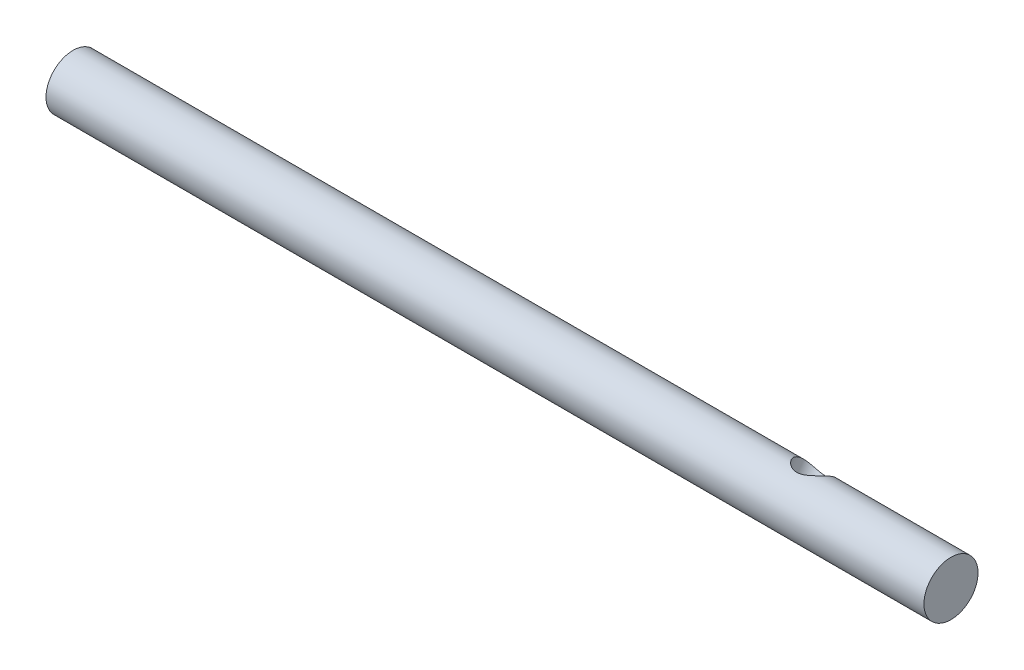
ISO-10303-21;
HEADER;
FILE_DESCRIPTION(('STEP AP214'),'2;1');
FILE_NAME('part.step','',(''),(''),'','','');
FILE_SCHEMA(('AUTOMOTIVE_DESIGN { 1 0 10303 214 1 1 1 1 }'));
ENDSEC;
DATA;
#1=APPLICATION_CONTEXT('core data for automotive mechanical design processes');
#2=APPLICATION_PROTOCOL_DEFINITION('international standard','automotive_design',2000,#1);
#3=PRODUCT_CONTEXT('',#1,'mechanical');
#4=PRODUCT('Part','Part','',(#3));
#5=PRODUCT_RELATED_PRODUCT_CATEGORY('part','',(#4));
#6=PRODUCT_DEFINITION_FORMATION('','',#4);
#7=PRODUCT_DEFINITION_CONTEXT('part definition',#1,'design');
#8=PRODUCT_DEFINITION('design','',#6,#7);
#9=PRODUCT_DEFINITION_SHAPE('','',#8);
#10=(LENGTH_UNIT() NAMED_UNIT(*) SI_UNIT(.MILLI.,.METRE.));
#11=(NAMED_UNIT(*) PLANE_ANGLE_UNIT() SI_UNIT($,.RADIAN.));
#12=(NAMED_UNIT(*) SI_UNIT($,.STERADIAN.) SOLID_ANGLE_UNIT());
#13=UNCERTAINTY_MEASURE_WITH_UNIT(LENGTH_MEASURE(1.E-05),#10,'distance_accuracy_value','');
#14=(GEOMETRIC_REPRESENTATION_CONTEXT(3) GLOBAL_UNCERTAINTY_ASSIGNED_CONTEXT((#13)) GLOBAL_UNIT_ASSIGNED_CONTEXT((#10,
#11,#12)) REPRESENTATION_CONTEXT('',''));
#15=CARTESIAN_POINT('',(0.,0.,0.));
#16=DIRECTION('',(0.,0.,1.));
#17=DIRECTION('',(1.,0.,0.));
#18=AXIS2_PLACEMENT_3D('',#15,#16,#17);
#19=CARTESIAN_POINT('',(75.,0.,0.));
#20=DIRECTION('',(-1.,0.,0.));
#21=DIRECTION('',(0.,0.,1.));
#22=AXIS2_PLACEMENT_3D('',#19,#20,#21);
#23=CYLINDRICAL_SURFACE('',#22,4.);
#24=CARTESIAN_POINT('',(54.8,0.,0.));
#25=DIRECTION('',(-1.,0.,0.));
#26=DIRECTION('',(0.,0.,1.));
#27=AXIS2_PLACEMENT_3D('',#24,#25,#26);
#28=CIRCLE('',#27,4.);
#29=CARTESIAN_POINT('',(54.8,0.,4.));
#30=VERTEX_POINT('',#29);
#31=EDGE_CURVE('E49',#30,#30,#28,.T.);
#32=ORIENTED_EDGE('',*,*,#31,.T.);
#33=EDGE_LOOP('',(#32));
#34=FACE_BOUND('',#33,.T.);
#35=CARTESIAN_POINT('',(-75.,0.,0.));
#36=DIRECTION('',(1.,0.,0.));
#37=DIRECTION('',(0.,0.,-1.));
#38=AXIS2_PLACEMENT_3D('',#35,#36,#37);
#39=CIRCLE('',#38,4.);
#40=CARTESIAN_POINT('',(-75.,0.,-4.));
#41=VERTEX_POINT('',#40);
#42=EDGE_CURVE('E10',#41,#41,#39,.T.);
#43=ORIENTED_EDGE('',*,*,#42,.T.);
#44=EDGE_LOOP('',(#43));
#45=FACE_BOUND('',#44,.T.);
#46=CARTESIAN_POINT('',(32.5,3.96760598785773,0.508038113841386));
#47=CARTESIAN_POINT('',(32.5621567514455,3.96760646337398,0.508037133767158));
#48=CARTESIAN_POINT('',(32.6243259466708,3.96798846958562,0.505082249115958));
#49=CARTESIAN_POINT('',(32.7481171795478,3.96946195000299,0.493356950870116));
#50=CARTESIAN_POINT('',(32.8097388732572,3.97055384206564,0.484583112029408));
#51=CARTESIAN_POINT('',(32.9932260477438,3.97470305889359,0.449796240194982));
#52=CARTESIAN_POINT('',(33.1135483311891,3.97863334539979,0.415318719272425));
#53=CARTESIAN_POINT('',(33.3455981978784,3.98681908924776,0.327357809187419));
#54=CARTESIAN_POINT('',(33.4573904150553,3.9910714823592,0.274039276072373));
#55=CARTESIAN_POINT('',(33.6720085253343,3.9975906488025,0.151727507772478));
#56=CARTESIAN_POINT('',(33.7748341737533,3.99985736796381,0.0827338450239749));
#57=CARTESIAN_POINT('',(33.9837339813039,4.0001474708343,-0.0782099803206769));
#58=CARTESIAN_POINT('',(34.0883933250048,3.99756079281937,-0.171998155787628));
#59=CARTESIAN_POINT('',(34.2837615516242,3.98387606959623,-0.37267210298567));
#60=CARTESIAN_POINT('',(34.3744582799541,3.97277065849401,-0.479569142321151));
#61=CARTESIAN_POINT('',(34.5502202981733,3.93723893065368,-0.717058541463337));
#62=CARTESIAN_POINT('',(34.6332861844511,3.91136719813231,-0.848953722227008));
#63=CARTESIAN_POINT('',(34.740545154737,3.85969848837524,-1.05245618022581));
#64=CARTESIAN_POINT('',(34.7734151383339,3.84032462930766,-1.12125425355681));
#65=CARTESIAN_POINT('',(34.8329546853642,3.79703556932582,-1.26007504310192));
#66=CARTESIAN_POINT('',(34.8596285310393,3.77312352570922,-1.33009687735458));
#67=CARTESIAN_POINT('',(34.9039838152572,3.72327429475606,-1.46348081326752));
#68=CARTESIAN_POINT('',(34.9223019765191,3.69778669692256,-1.52680002767152));
#69=CARTESIAN_POINT('',(34.9533022863144,3.64304982143287,-1.65315582331957));
#70=CARTESIAN_POINT('',(34.9659876892173,3.61380272848308,-1.71619254687884));
#71=CARTESIAN_POINT('',(34.9855137976356,3.55167135750614,-1.84133203349514));
#72=CARTESIAN_POINT('',(34.9923581165145,3.51878934232741,-1.90343535057281));
#73=CARTESIAN_POINT('',(35.0000992133904,3.44963446447042,-2.02607729684202));
#74=CARTESIAN_POINT('',(35.0009966759645,3.41336199257485,-2.086616105334));
#75=CARTESIAN_POINT('',(34.9952746264539,3.31011380074642,-2.24898808420586));
#76=CARTESIAN_POINT('',(34.9826934969223,3.24004415233395,-2.3487265055166));
#77=CARTESIAN_POINT('',(34.9402697820351,3.09317965354079,-2.53904151600358));
#78=CARTESIAN_POINT('',(34.9104258920276,3.01638429522954,-2.62961741210407));
#79=CARTESIAN_POINT('',(34.8347914407179,2.85867443349045,-2.80027071143355));
#80=CARTESIAN_POINT('',(34.7889600804301,2.7777498479828,-2.8803205261576));
#81=CARTESIAN_POINT('',(34.6830627610169,2.61482037124375,-3.02900993017709));
#82=CARTESIAN_POINT('',(34.6229935589375,2.53281523792061,-3.0976469139023));
#83=CARTESIAN_POINT('',(34.4819435830775,2.36029443664313,-3.23146356879784));
#84=CARTESIAN_POINT('',(34.3992907233107,2.26998967368184,-3.29515000744864));
#85=CARTESIAN_POINT('',(34.2197352627941,2.09502887192758,-3.40907352658947));
#86=CARTESIAN_POINT('',(34.1228119536172,2.01038130652956,-3.45929075740001));
#87=CARTESIAN_POINT('',(33.9025887468277,1.8403273487674,-3.55299696342969));
#88=CARTESIAN_POINT('',(33.777497236643,1.75626541116432,-3.59475091144558));
#89=CARTESIAN_POINT('',(33.5127077626997,1.60743901204859,-3.66372636960703));
#90=CARTESIAN_POINT('',(33.3730373125479,1.5426390578519,-3.69097468248396));
#91=CARTESIAN_POINT('',(33.1204611938947,1.45369083849844,-3.72672099748441));
#92=CARTESIAN_POINT('',(33.0101780747874,1.42333321165388,-3.73826567048842));
#93=CARTESIAN_POINT('',(32.7857696224409,1.3802949283096,-3.75437533227027));
#94=CARTESIAN_POINT('',(32.6716497573439,1.36759012272249,-3.75894985705169));
#95=CARTESIAN_POINT('',(32.4425426394981,1.36127569523967,-3.76124238571308));
#96=CARTESIAN_POINT('',(32.3275539995221,1.36770983270951,-3.75894467682121));
#97=CARTESIAN_POINT('',(32.1004388356819,1.39899829584411,-3.74740770650197));
#98=CARTESIAN_POINT('',(31.9883147616291,1.42386787591763,-3.73816269644251));
#99=CARTESIAN_POINT('',(31.7715632405745,1.48888953474344,-3.71273290739743));
#100=CARTESIAN_POINT('',(31.6668426841058,1.52878293208048,-3.69666503882699));
#101=CARTESIAN_POINT('',(31.4644253001062,1.62078941217104,-3.65725868047772));
#102=CARTESIAN_POINT('',(31.366730981122,1.67290683119242,-3.63391760968415));
#103=CARTESIAN_POINT('',(31.1613880583367,1.79725695156998,-3.57427933044108));
#104=CARTESIAN_POINT('',(31.055385472698,1.8714302305422,-3.53636148480979));
#105=CARTESIAN_POINT('',(30.8556293393454,2.02876249635853,-3.44851480169962));
#106=CARTESIAN_POINT('',(30.7618886787573,2.11193077181958,-3.39857348177079));
#107=CARTESIAN_POINT('',(30.5740359293586,2.29735645761288,-3.27663867071156));
#108=CARTESIAN_POINT('',(30.4822726015146,2.40053687607224,-3.2023936083623));
#109=CARTESIAN_POINT('',(30.3198529852796,2.60865202943235,-3.03523627809282));
#110=CARTESIAN_POINT('',(30.2491868048724,2.71358591771828,-2.94233279300979));
#111=CARTESIAN_POINT('',(30.1634189320242,2.86476256098932,-2.79245688034801));
#112=CARTESIAN_POINT('',(30.1387025560479,2.91267821475926,-2.74248693202896));
#113=CARTESIAN_POINT('',(30.0950617232668,3.00698149450986,-2.6387423831278));
#114=CARTESIAN_POINT('',(30.0761339138482,3.05336999104053,-2.58497000713657));
#115=CARTESIAN_POINT('',(30.0443941698598,3.14397272649203,-2.47397684708055));
#116=CARTESIAN_POINT('',(30.0315769004826,3.18818883165242,-2.4167591203243));
#117=CARTESIAN_POINT('',(30.0122608277061,3.27389477889936,-2.29932775402522));
#118=CARTESIAN_POINT('',(30.0057609790682,3.31538507092135,-2.23911461181755));
#119=CARTESIAN_POINT('',(29.9969284844918,3.42319796377469,-2.07297201323309));
#120=CARTESIAN_POINT('',(30.0007342070895,3.4864815087952,-1.96465174493676));
#121=CARTESIAN_POINT('',(30.0269175895443,3.60173949654348,-1.74440783625371));
#122=CARTESIAN_POINT('',(30.0492944066776,3.65371445230028,-1.63248435959583));
#123=CARTESIAN_POINT('',(30.1103224155448,3.74412813997005,-1.41250198674164));
#124=CARTESIAN_POINT('',(30.1483820735634,3.78297392348008,-1.30444372691554));
#125=CARTESIAN_POINT('',(30.2391194624421,3.84989905221422,-1.09122948614603));
#126=CARTESIAN_POINT('',(30.2917996595658,3.87797657909159,-0.986073998149482));
#127=CARTESIAN_POINT('',(30.4163212787186,3.92680896656312,-0.770468351191028));
#128=CARTESIAN_POINT('',(30.4895839907561,3.94650128754159,-0.660601505382594));
#129=CARTESIAN_POINT('',(30.6501532325127,3.97601968046254,-0.450101678565831));
#130=CARTESIAN_POINT('',(30.7374756088328,3.98583452795371,-0.349479320379346));
#131=CARTESIAN_POINT('',(30.9382325150604,3.99878572582302,-0.146526226105475));
#132=CARTESIAN_POINT('',(31.05361661257,4.00075550958596,-0.0460398415495947));
#133=CARTESIAN_POINT('',(31.2992894097584,3.99875268898497,0.134744803150844));
#134=CARTESIAN_POINT('',(31.4295698111512,3.99478337836106,0.215054224319079));
#135=CARTESIAN_POINT('',(31.6728053007836,3.98630029662755,0.334960513470497));
#136=CARTESIAN_POINT('',(31.7832705721522,3.98209818167976,0.379626603474896));
#137=CARTESIAN_POINT('',(32.0099393430004,3.97475855054525,0.450090651334803));
#138=CARTESIAN_POINT('',(32.1261234197984,3.97161768207595,0.475948325627414));
#139=CARTESIAN_POINT('',(32.286059994645,3.96902326149096,0.496863446198028));
#140=CARTESIAN_POINT('',(32.3287255257078,3.9684956997781,0.50104604479768));
#141=CARTESIAN_POINT('',(32.4142586989513,3.96778685542303,0.506634065829735));
#142=CARTESIAN_POINT('',(32.4571263892432,3.9676056598628,0.508038789863218));
#143=CARTESIAN_POINT('',(32.5,3.96760598785773,0.508038113841386));
#144=B_SPLINE_CURVE_WITH_KNOTS('',3,(#46,#47,#48,#49,#50,#51,#52,#53,#54,#55,#56,#57,#58,#59,
#60,#61,#62,#63,#64,#65,#66,#67,#68,#69,#70,#71,#72,#73,#74,#75,#76,#77,#78,#79,#80,#81,#82,#83,
#84,#85,#86,#87,#88,#89,#90,#91,#92,#93,#94,#95,#96,#97,#98,#99,#100,#101,#102,#103,#104,#105,
#106,#107,#108,#109,#110,#111,#112,#113,#114,#115,#116,#117,#118,#119,#120,#121,#122,#123,#124,
#125,#126,#127,#128,#129,#130,#131,#132,#133,#134,#135,#136,#137,#138,#139,#140,#141,#142,#143),
.UNSPECIFIED.,.T.,.F.,(4,2,2,2,2,2,2,2,2,2,2,2,2,2,2,2,2,2,2,2,2,2,2,2,2,2,2,2,2,2,2,2,2,2,2,2,
2,2,2,2,2,2,2,2,2,2,2,2,4),(0.,0.186415315858491,0.372940459994559,0.746478880764812,
1.11682668423151,1.48718459072629,1.9072279868511,2.32763499192935,2.79876029266061,
3.03445880867424,3.26999394209637,3.48170145743349,3.69328649746663,3.9047405534277,
4.11617026726057,4.4818470970832,4.84755156694142,5.21419620193236,5.58092442797675,
5.99329080205556,6.40626158573721,6.87316206383776,7.33919680735771,7.68265621505771,
8.02564530559835,8.36941921026754,8.71347788865458,9.05186495232507,9.39037223519596,
9.79332737765597,10.1967026751586,10.6647326786715,11.1325428866864,11.3527929661085,
11.5729152387494,11.7928449800852,12.0127383271051,12.3871595324285,12.7615637480977,
13.1229788842147,13.4844550226839,13.8834503841014,14.282898641104,14.7399238503519,
15.196695693635,15.5530255473356,15.9082190611951,16.0367696833456,16.1653526209246),.UNSPECIFIED.);
#145=CARTESIAN_POINT('',(32.5,3.96760598785773,0.508038113841386));
#146=VERTEX_POINT('',#145);
#147=EDGE_CURVE('E54',#146,#146,#144,.T.);
#148=ORIENTED_EDGE('',*,*,#147,.F.);
#149=EDGE_LOOP('',(#148));
#150=FACE_BOUND('',#149,.T.);
#151=ADVANCED_FACE('F45',(#34,#45,#150),#23,.T.);
#152=CARTESIAN_POINT('',(-75.,0.,0.));
#153=DIRECTION('',(1.,0.,0.));
#154=DIRECTION('',(0.,0.,-1.));
#155=AXIS2_PLACEMENT_3D('',#152,#153,#154);
#156=PLANE('',#155);
#157=ORIENTED_EDGE('',*,*,#42,.F.);
#158=EDGE_LOOP('',(#157));
#159=FACE_BOUND('',#158,.T.);
#160=ADVANCED_FACE('F71',(#159),#156,.F.);
#161=CARTESIAN_POINT('',(32.5,1.46715448274903,-0.895040761319632));
#162=DIRECTION('',(0.,0.853683813181221,-0.52079165422688));
#163=DIRECTION('',(0.,0.52079165422688,0.853683813181221));
#164=AXIS2_PLACEMENT_3D('',#161,#162,#163);
#165=CYLINDRICAL_SURFACE('',#164,2.50000000000112);
#166=CARTESIAN_POINT('',(32.5,1.46715448274903,-0.895040761319632));
#167=DIRECTION('',(0.,-0.853683813181221,0.52079165422688));
#168=DIRECTION('',(0.,-0.52079165422688,-0.853683813181221));
#169=AXIS2_PLACEMENT_3D('',#166,#167,#168);
#170=CIRCLE('',#169,2.50000000000112);
#171=CARTESIAN_POINT('',(32.5,0.165175347181248,-3.02925029427364));
#172=VERTEX_POINT('',#171);
#173=EDGE_CURVE('E60',#172,#172,#170,.T.);
#174=ORIENTED_EDGE('',*,*,#173,.T.);
#175=EDGE_LOOP('',(#174));
#176=FACE_BOUND('',#175,.T.);
#177=ORIENTED_EDGE('',*,*,#147,.T.);
#178=EDGE_LOOP('',(#177));
#179=FACE_BOUND('',#178,.T.);
#180=ADVANCED_FACE('F66',(#176,#179),#165,.F.);
#181=CARTESIAN_POINT('',(32.5,1.46715448274903,-0.895040761319632));
#182=DIRECTION('',(0.,-0.853683813181221,0.52079165422688));
#183=DIRECTION('',(0.,-0.52079165422688,-0.853683813181221));
#184=AXIS2_PLACEMENT_3D('',#181,#182,#183);
#185=PLANE('',#184);
#186=ORIENTED_EDGE('',*,*,#173,.F.);
#187=EDGE_LOOP('',(#186));
#188=FACE_BOUND('',#187,.T.);
#189=ADVANCED_FACE('F70',(#188),#185,.F.);
#190=CARTESIAN_POINT('',(54.8,-5.,-24.7707401033536));
#191=DIRECTION('',(-1.,0.,0.));
#192=DIRECTION('',(0.,0.,1.));
#193=AXIS2_PLACEMENT_3D('',#190,#191,#192);
#194=PLANE('',#193);
#195=ORIENTED_EDGE('',*,*,#31,.F.);
#196=EDGE_LOOP('',(#195));
#197=FACE_BOUND('',#196,.T.);
#198=ADVANCED_FACE('F95',(#197),#194,.F.);
#199=CLOSED_SHELL('',(#151,#160,#180,#189,#198));
#200=MANIFOLD_SOLID_BREP('B2',#199);
#201=ADVANCED_BREP_SHAPE_REPRESENTATION('',(#18,#200),#14);
#202=SHAPE_DEFINITION_REPRESENTATION(#9,#201);
ENDSEC;
END-ISO-10303-21;
